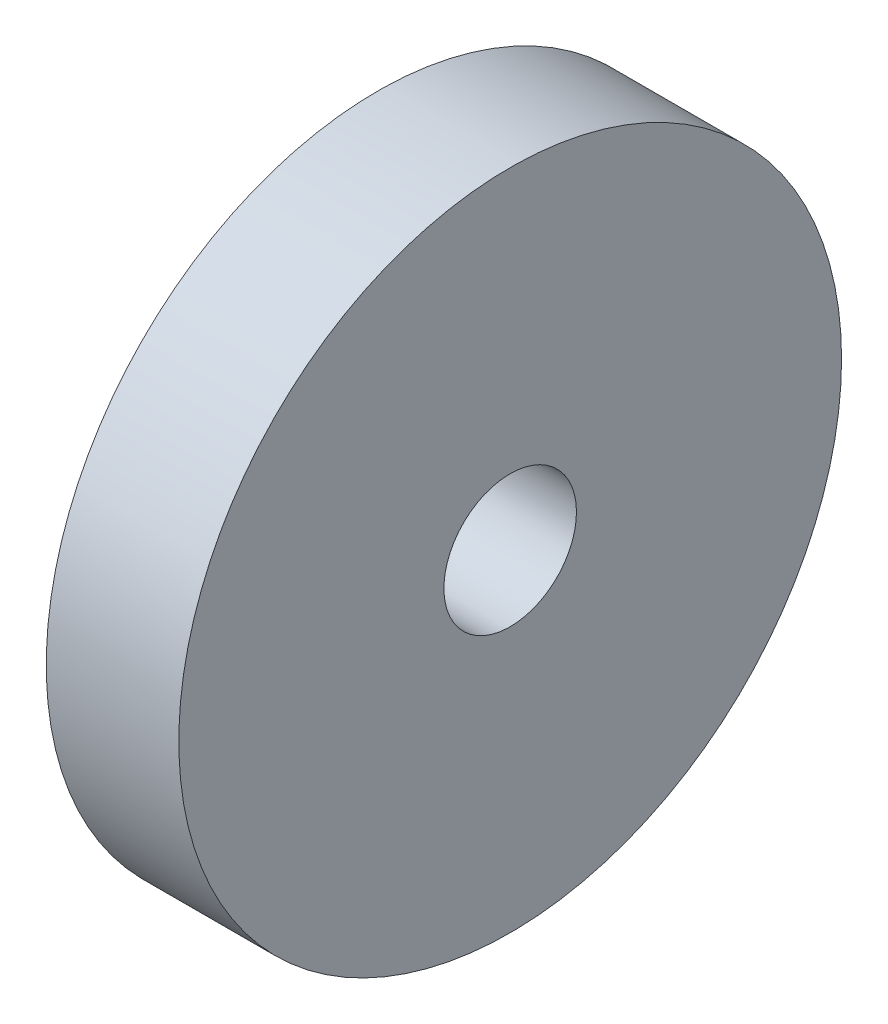
ISO-10303-21;
HEADER;
FILE_DESCRIPTION(('STEP AP214'),'2;1');
FILE_NAME('part.step','',(''),(''),'','','');
FILE_SCHEMA(('AUTOMOTIVE_DESIGN { 1 0 10303 214 1 1 1 1 }'));
ENDSEC;
DATA;
#1=APPLICATION_CONTEXT('core data for automotive mechanical design processes');
#2=APPLICATION_PROTOCOL_DEFINITION('international standard','automotive_design',2000,#1);
#3=PRODUCT_CONTEXT('',#1,'mechanical');
#4=PRODUCT('Part','Part','',(#3));
#5=PRODUCT_RELATED_PRODUCT_CATEGORY('part','',(#4));
#6=PRODUCT_DEFINITION_FORMATION('','',#4);
#7=PRODUCT_DEFINITION_CONTEXT('part definition',#1,'design');
#8=PRODUCT_DEFINITION('design','',#6,#7);
#9=PRODUCT_DEFINITION_SHAPE('','',#8);
#10=(LENGTH_UNIT() NAMED_UNIT(*) SI_UNIT(.MILLI.,.METRE.));
#11=(NAMED_UNIT(*) PLANE_ANGLE_UNIT() SI_UNIT($,.RADIAN.));
#12=(NAMED_UNIT(*) SI_UNIT($,.STERADIAN.) SOLID_ANGLE_UNIT());
#13=UNCERTAINTY_MEASURE_WITH_UNIT(LENGTH_MEASURE(1.E-05),#10,'distance_accuracy_value','');
#14=(GEOMETRIC_REPRESENTATION_CONTEXT(3) GLOBAL_UNCERTAINTY_ASSIGNED_CONTEXT((#13)) GLOBAL_UNIT_ASSIGNED_CONTEXT((#10,
#11,#12)) REPRESENTATION_CONTEXT('',''));
#15=CARTESIAN_POINT('',(0.,0.,0.));
#16=DIRECTION('',(0.,0.,1.));
#17=DIRECTION('',(1.,0.,0.));
#18=AXIS2_PLACEMENT_3D('',#15,#16,#17);
#19=CARTESIAN_POINT('',(3.,0.,0.));
#20=DIRECTION('',(-1.,0.,0.));
#21=DIRECTION('',(0.,0.,1.));
#22=AXIS2_PLACEMENT_3D('',#19,#20,#21);
#23=CYLINDRICAL_SURFACE('',#22,7.5);
#24=CARTESIAN_POINT('',(3.,0.,0.));
#25=DIRECTION('',(1.,0.,0.));
#26=DIRECTION('',(0.,0.,-1.));
#27=AXIS2_PLACEMENT_3D('',#24,#25,#26);
#28=CIRCLE('',#27,7.5);
#29=CARTESIAN_POINT('',(3.,0.,-7.5));
#30=VERTEX_POINT('',#29);
#31=EDGE_CURVE('E10',#30,#30,#28,.T.);
#32=ORIENTED_EDGE('',*,*,#31,.F.);
#33=EDGE_LOOP('',(#32));
#34=FACE_BOUND('',#33,.T.);
#35=CARTESIAN_POINT('',(0.,0.,0.));
#36=DIRECTION('',(1.,0.,0.));
#37=DIRECTION('',(0.,0.,-1.));
#38=AXIS2_PLACEMENT_3D('',#35,#36,#37);
#39=CIRCLE('',#38,7.5);
#40=CARTESIAN_POINT('',(0.,0.,-7.5));
#41=VERTEX_POINT('',#40);
#42=EDGE_CURVE('E34',#41,#41,#39,.T.);
#43=ORIENTED_EDGE('',*,*,#42,.T.);
#44=EDGE_LOOP('',(#43));
#45=FACE_BOUND('',#44,.T.);
#46=ADVANCED_FACE('F31',(#34,#45),#23,.T.);
#47=CARTESIAN_POINT('',(3.,0.,0.));
#48=DIRECTION('',(1.,0.,0.));
#49=DIRECTION('',(0.,0.,-1.));
#50=AXIS2_PLACEMENT_3D('',#47,#48,#49);
#51=PLANE('',#50);
#52=CARTESIAN_POINT('',(3.,0.,0.));
#53=DIRECTION('',(1.,0.,0.));
#54=DIRECTION('',(0.,0.,-1.));
#55=AXIS2_PLACEMENT_3D('',#52,#53,#54);
#56=CIRCLE('',#55,1.5);
#57=CARTESIAN_POINT('',(3.,0.,-1.5));
#58=VERTEX_POINT('',#57);
#59=EDGE_CURVE('E43',#58,#58,#56,.T.);
#60=ORIENTED_EDGE('',*,*,#59,.F.);
#61=EDGE_LOOP('',(#60));
#62=FACE_BOUND('',#61,.T.);
#63=ORIENTED_EDGE('',*,*,#31,.T.);
#64=EDGE_LOOP('',(#63));
#65=FACE_BOUND('',#64,.T.);
#66=ADVANCED_FACE('F58',(#62,#65),#51,.T.);
#67=CARTESIAN_POINT('',(0.,0.,0.));
#68=DIRECTION('',(1.,0.,0.));
#69=DIRECTION('',(0.,0.,-1.));
#70=AXIS2_PLACEMENT_3D('',#67,#68,#69);
#71=PLANE('',#70);
#72=CARTESIAN_POINT('',(0.,0.,0.));
#73=DIRECTION('',(1.,0.,0.));
#74=DIRECTION('',(0.,0.,-1.));
#75=AXIS2_PLACEMENT_3D('',#72,#73,#74);
#76=CIRCLE('',#75,1.5);
#77=CARTESIAN_POINT('',(0.,0.,-1.5));
#78=VERTEX_POINT('',#77);
#79=EDGE_CURVE('E41',#78,#78,#76,.T.);
#80=ORIENTED_EDGE('',*,*,#79,.T.);
#81=EDGE_LOOP('',(#80));
#82=FACE_BOUND('',#81,.T.);
#83=ORIENTED_EDGE('',*,*,#42,.F.);
#84=EDGE_LOOP('',(#83));
#85=FACE_BOUND('',#84,.T.);
#86=ADVANCED_FACE('F49',(#82,#85),#71,.F.);
#87=CARTESIAN_POINT('',(0.,0.,0.));
#88=DIRECTION('',(1.,0.,0.));
#89=DIRECTION('',(0.,0.,-1.));
#90=AXIS2_PLACEMENT_3D('',#87,#88,#89);
#91=CYLINDRICAL_SURFACE('',#90,1.5);
#92=ORIENTED_EDGE('',*,*,#79,.F.);
#93=EDGE_LOOP('',(#92));
#94=FACE_BOUND('',#93,.T.);
#95=ORIENTED_EDGE('',*,*,#59,.T.);
#96=EDGE_LOOP('',(#95));
#97=FACE_BOUND('',#96,.T.);
#98=ADVANCED_FACE('F52',(#94,#97),#91,.F.);
#99=CLOSED_SHELL('',(#46,#66,#86,#98));
#100=MANIFOLD_SOLID_BREP('B2',#99);
#101=ADVANCED_BREP_SHAPE_REPRESENTATION('',(#18,#100),#14);
#102=SHAPE_DEFINITION_REPRESENTATION(#9,#101);
ENDSEC;
END-ISO-10303-21;
